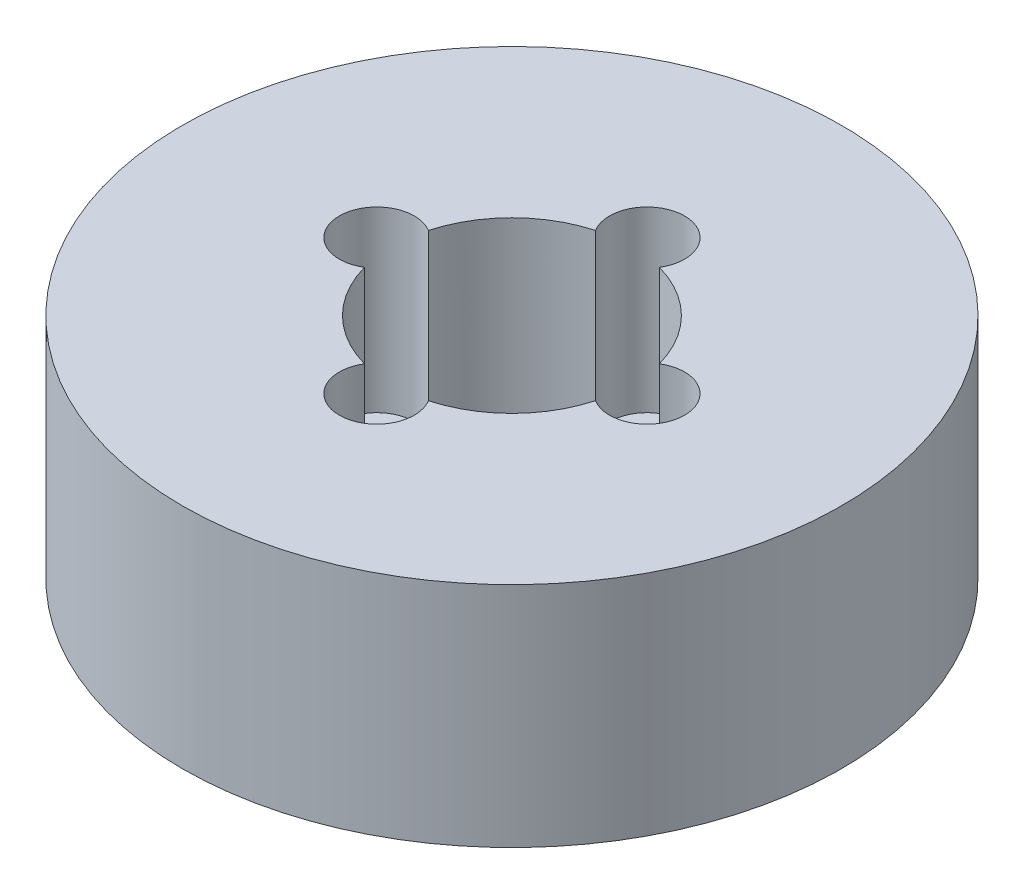
ISO-10303-21;
HEADER;
FILE_DESCRIPTION(('STEP AP214'),'2;1');
FILE_NAME('part.step','',(''),(''),'','','');
FILE_SCHEMA(('AUTOMOTIVE_DESIGN { 1 0 10303 214 1 1 1 1 }'));
ENDSEC;
DATA;
#1=APPLICATION_CONTEXT('core data for automotive mechanical design processes');
#2=APPLICATION_PROTOCOL_DEFINITION('international standard','automotive_design',2000,#1);
#3=PRODUCT_CONTEXT('',#1,'mechanical');
#4=PRODUCT('Part','Part','',(#3));
#5=PRODUCT_RELATED_PRODUCT_CATEGORY('part','',(#4));
#6=PRODUCT_DEFINITION_FORMATION('','',#4);
#7=PRODUCT_DEFINITION_CONTEXT('part definition',#1,'design');
#8=PRODUCT_DEFINITION('design','',#6,#7);
#9=PRODUCT_DEFINITION_SHAPE('','',#8);
#10=(LENGTH_UNIT() NAMED_UNIT(*) SI_UNIT(.MILLI.,.METRE.));
#11=(NAMED_UNIT(*) PLANE_ANGLE_UNIT() SI_UNIT($,.RADIAN.));
#12=(NAMED_UNIT(*) SI_UNIT($,.STERADIAN.) SOLID_ANGLE_UNIT());
#13=UNCERTAINTY_MEASURE_WITH_UNIT(LENGTH_MEASURE(1.E-05),#10,'distance_accuracy_value','');
#14=(GEOMETRIC_REPRESENTATION_CONTEXT(3) GLOBAL_UNCERTAINTY_ASSIGNED_CONTEXT((#13)) GLOBAL_UNIT_ASSIGNED_CONTEXT((#10,
#11,#12)) REPRESENTATION_CONTEXT('',''));
#15=CARTESIAN_POINT('',(0.,0.,0.));
#16=DIRECTION('',(0.,0.,1.));
#17=DIRECTION('',(1.,0.,0.));
#18=AXIS2_PLACEMENT_3D('',#15,#16,#17);
#19=CARTESIAN_POINT('',(0.,19.,0.));
#20=DIRECTION('',(0.,-1.,0.));
#21=DIRECTION('',(0.,0.,-1.));
#22=AXIS2_PLACEMENT_3D('',#19,#20,#21);
#23=CYLINDRICAL_SURFACE('',#22,27.5);
#24=CARTESIAN_POINT('',(0.,19.,0.));
#25=DIRECTION('',(0.,1.,0.));
#26=DIRECTION('',(0.,0.,1.));
#27=AXIS2_PLACEMENT_3D('',#24,#25,#26);
#28=CIRCLE('',#27,27.5);
#29=CARTESIAN_POINT('',(0.,19.,27.5));
#30=VERTEX_POINT('',#29);
#31=EDGE_CURVE('E145',#30,#30,#28,.T.);
#32=ORIENTED_EDGE('',*,*,#31,.F.);
#33=EDGE_LOOP('',(#32));
#34=FACE_BOUND('',#33,.T.);
#35=CARTESIAN_POINT('',(0.,0.,0.));
#36=DIRECTION('',(0.,1.,0.));
#37=DIRECTION('',(0.,0.,1.));
#38=AXIS2_PLACEMENT_3D('',#35,#36,#37);
#39=CIRCLE('',#38,27.5);
#40=CARTESIAN_POINT('',(0.,0.,27.5));
#41=VERTEX_POINT('',#40);
#42=EDGE_CURVE('E143',#41,#41,#39,.T.);
#43=ORIENTED_EDGE('',*,*,#42,.T.);
#44=EDGE_LOOP('',(#43));
#45=FACE_BOUND('',#44,.T.);
#46=ADVANCED_FACE('F39',(#34,#45),#23,.T.);
#47=CARTESIAN_POINT('',(0.,19.,0.));
#48=DIRECTION('',(0.,1.,0.));
#49=DIRECTION('',(0.,0.,1.));
#50=AXIS2_PLACEMENT_3D('',#47,#48,#49);
#51=PLANE('',#50);
#52=CARTESIAN_POINT('',(0.,19.,11.2742594258301));
#53=DIRECTION('',(0.,1.,0.));
#54=DIRECTION('',(1.,0.,0.));
#55=AXIS2_PLACEMENT_3D('',#52,#53,#54);
#56=CIRCLE('',#55,3.1296043589413);
#57=CARTESIAN_POINT('',(-2.66756435026273,19.,9.63763977523581));
#58=VERTEX_POINT('',#57);
#59=CARTESIAN_POINT('',(2.6675643502628,19.,9.63763977523579));
#60=VERTEX_POINT('',#59);
#61=EDGE_CURVE('E152',#58,#60,#56,.T.);
#62=ORIENTED_EDGE('',*,*,#61,.F.);
#63=CARTESIAN_POINT('',(0.,19.,0.));
#64=DIRECTION('',(0.,1.,0.));
#65=DIRECTION('',(0.,0.,1.));
#66=AXIS2_PLACEMENT_3D('',#63,#64,#65);
#67=CIRCLE('',#66,10.);
#68=CARTESIAN_POINT('',(-9.6376397752358,19.,2.66756435026276));
#69=VERTEX_POINT('',#68);
#70=EDGE_CURVE('E133',#69,#58,#67,.T.);
#71=ORIENTED_EDGE('',*,*,#70,.F.);
#72=CARTESIAN_POINT('',(-11.2742594258301,19.,0.));
#73=DIRECTION('',(0.,1.,0.));
#74=DIRECTION('',(0.,0.,1.));
#75=AXIS2_PLACEMENT_3D('',#72,#73,#74);
#76=CIRCLE('',#75,3.1296043589413);
#77=CARTESIAN_POINT('',(-9.6376397752358,19.,-2.66756435026276));
#78=VERTEX_POINT('',#77);
#79=EDGE_CURVE('E128',#78,#69,#76,.T.);
#80=ORIENTED_EDGE('',*,*,#79,.F.);
#81=CARTESIAN_POINT('',(-2.66756435026286,19.,-9.63763977523577));
#82=VERTEX_POINT('',#81);
#83=EDGE_CURVE('E121',#82,#78,#67,.T.);
#84=ORIENTED_EDGE('',*,*,#83,.F.);
#85=CARTESIAN_POINT('',(-1.18091599183687E-13,19.,-11.2742594258301));
#86=DIRECTION('',(0.,1.,0.));
#87=DIRECTION('',(-1.,0.,0.));
#88=AXIS2_PLACEMENT_3D('',#85,#86,#87);
#89=CIRCLE('',#88,3.1296043589413);
#90=CARTESIAN_POINT('',(2.66756435026266,19.,-9.63763977523583));
#91=VERTEX_POINT('',#90);
#92=EDGE_CURVE('E105',#91,#82,#89,.T.);
#93=ORIENTED_EDGE('',*,*,#92,.F.);
#94=CARTESIAN_POINT('',(9.6376397752358,19.,-2.66756435026276));
#95=VERTEX_POINT('',#94);
#96=EDGE_CURVE('E131',#95,#91,#67,.T.);
#97=ORIENTED_EDGE('',*,*,#96,.F.);
#98=CARTESIAN_POINT('',(11.2742594258301,19.,0.));
#99=DIRECTION('',(0.,1.,0.));
#100=DIRECTION('',(0.,0.,-1.));
#101=AXIS2_PLACEMENT_3D('',#98,#99,#100);
#102=CIRCLE('',#101,3.1296043589413);
#103=CARTESIAN_POINT('',(9.6376397752358,19.,2.66756435026276));
#104=VERTEX_POINT('',#103);
#105=EDGE_CURVE('E154',#104,#95,#102,.T.);
#106=ORIENTED_EDGE('',*,*,#105,.F.);
#107=EDGE_CURVE('E134',#60,#104,#67,.T.);
#108=ORIENTED_EDGE('',*,*,#107,.F.);
#109=EDGE_LOOP('',(#62,#71,#80,#84,#93,#97,#106,#108));
#110=FACE_BOUND('',#109,.T.);
#111=ORIENTED_EDGE('',*,*,#31,.T.);
#112=EDGE_LOOP('',(#111));
#113=FACE_BOUND('',#112,.T.);
#114=ADVANCED_FACE('F130',(#110,#113),#51,.T.);
#115=CARTESIAN_POINT('',(0.,0.,0.));
#116=DIRECTION('',(0.,1.,0.));
#117=DIRECTION('',(0.,0.,1.));
#118=AXIS2_PLACEMENT_3D('',#115,#116,#117);
#119=PLANE('',#118);
#120=CARTESIAN_POINT('',(0.,0.,0.));
#121=DIRECTION('',(0.,1.,0.));
#122=DIRECTION('',(0.,0.,1.));
#123=AXIS2_PLACEMENT_3D('',#120,#121,#122);
#124=CIRCLE('',#123,10.);
#125=CARTESIAN_POINT('',(0.,0.,10.));
#126=VERTEX_POINT('',#125);
#127=EDGE_CURVE('E135',#126,#126,#124,.T.);
#128=ORIENTED_EDGE('',*,*,#127,.T.);
#129=EDGE_LOOP('',(#128));
#130=FACE_BOUND('',#129,.T.);
#131=ORIENTED_EDGE('',*,*,#42,.F.);
#132=EDGE_LOOP('',(#131));
#133=FACE_BOUND('',#132,.T.);
#134=ADVANCED_FACE('F195',(#130,#133),#119,.F.);
#135=CARTESIAN_POINT('',(0.,19.,0.));
#136=DIRECTION('',(0.,-1.,0.));
#137=DIRECTION('',(0.,0.,-1.));
#138=AXIS2_PLACEMENT_3D('',#135,#136,#137);
#139=CYLINDRICAL_SURFACE('',#138,10.);
#140=DIRECTION('',(0.,1.,0.));
#141=VECTOR('',#140,1.);
#142=CARTESIAN_POINT('',(-2.66756435026273,11.5670114960892,9.63763977523581));
#143=LINE('',#142,#141);
#144=CARTESIAN_POINT('',(-2.66756435026273,4.13402299217838,9.63763977523581));
#145=VERTEX_POINT('',#144);
#146=EDGE_CURVE('E11',#145,#58,#143,.T.);
#147=ORIENTED_EDGE('',*,*,#146,.F.);
#148=CARTESIAN_POINT('',(0.,4.13402299217838,0.));
#149=DIRECTION('',(0.,1.,0.));
#150=DIRECTION('',(0.,0.,1.));
#151=AXIS2_PLACEMENT_3D('',#148,#149,#150);
#152=CIRCLE('',#151,10.);
#153=CARTESIAN_POINT('',(2.6675643502628,4.13402299217838,9.63763977523579));
#154=VERTEX_POINT('',#153);
#155=EDGE_CURVE('E169',#145,#154,#152,.T.);
#156=ORIENTED_EDGE('',*,*,#155,.T.);
#157=DIRECTION('',(0.,1.,0.));
#158=VECTOR('',#157,1.);
#159=CARTESIAN_POINT('',(2.6675643502628,11.5670114960892,9.63763977523579));
#160=LINE('',#159,#158);
#161=EDGE_CURVE('E46',#60,#154,#160,.F.);
#162=ORIENTED_EDGE('',*,*,#161,.F.);
#163=ORIENTED_EDGE('',*,*,#107,.T.);
#164=DIRECTION('',(0.,1.,0.));
#165=VECTOR('',#164,1.);
#166=CARTESIAN_POINT('',(9.6376397752358,11.5670114960892,2.66756435026276));
#167=LINE('',#166,#165);
#168=CARTESIAN_POINT('',(9.6376397752358,4.13402299217838,2.66756435026276));
#169=VERTEX_POINT('',#168);
#170=EDGE_CURVE('E151',#169,#104,#167,.T.);
#171=ORIENTED_EDGE('',*,*,#170,.F.);
#172=CARTESIAN_POINT('',(0.,4.13402299217838,0.));
#173=DIRECTION('',(0.,1.,0.));
#174=DIRECTION('',(0.,0.,1.));
#175=AXIS2_PLACEMENT_3D('',#172,#173,#174);
#176=CIRCLE('',#175,10.);
#177=CARTESIAN_POINT('',(9.6376397752358,4.13402299217838,-2.66756435026276));
#178=VERTEX_POINT('',#177);
#179=EDGE_CURVE('E173',#169,#178,#176,.T.);
#180=ORIENTED_EDGE('',*,*,#179,.T.);
#181=DIRECTION('',(0.,1.,0.));
#182=VECTOR('',#181,1.);
#183=CARTESIAN_POINT('',(9.6376397752358,11.5670114960892,-2.66756435026276));
#184=LINE('',#183,#182);
#185=EDGE_CURVE('E168',#95,#178,#184,.F.);
#186=ORIENTED_EDGE('',*,*,#185,.F.);
#187=ORIENTED_EDGE('',*,*,#96,.T.);
#188=DIRECTION('',(0.,1.,0.));
#189=VECTOR('',#188,1.);
#190=CARTESIAN_POINT('',(2.66756435026266,11.5670114960892,-9.63763977523583));
#191=LINE('',#190,#189);
#192=CARTESIAN_POINT('',(2.66756435026266,4.13402299217838,-9.63763977523583));
#193=VERTEX_POINT('',#192);
#194=EDGE_CURVE('E108',#193,#91,#191,.T.);
#195=ORIENTED_EDGE('',*,*,#194,.F.);
#196=CARTESIAN_POINT('',(0.,4.13402299217838,0.));
#197=DIRECTION('',(0.,1.,0.));
#198=DIRECTION('',(0.,0.,1.));
#199=AXIS2_PLACEMENT_3D('',#196,#197,#198);
#200=CIRCLE('',#199,10.);
#201=CARTESIAN_POINT('',(-2.66756435026286,4.13402299217838,-9.63763977523577));
#202=VERTEX_POINT('',#201);
#203=EDGE_CURVE('E122',#193,#202,#200,.T.);
#204=ORIENTED_EDGE('',*,*,#203,.T.);
#205=DIRECTION('',(0.,1.,0.));
#206=VECTOR('',#205,1.);
#207=CARTESIAN_POINT('',(-2.66756435026286,11.5670114960892,-9.63763977523577));
#208=LINE('',#207,#206);
#209=EDGE_CURVE('E106',#82,#202,#208,.F.);
#210=ORIENTED_EDGE('',*,*,#209,.F.);
#211=ORIENTED_EDGE('',*,*,#83,.T.);
#212=DIRECTION('',(0.,1.,0.));
#213=VECTOR('',#212,1.);
#214=CARTESIAN_POINT('',(-9.6376397752358,11.5670114960892,-2.66756435026276));
#215=LINE('',#214,#213);
#216=CARTESIAN_POINT('',(-9.6376397752358,4.13402299217838,-2.66756435026276));
#217=VERTEX_POINT('',#216);
#218=EDGE_CURVE('E177',#217,#78,#215,.T.);
#219=ORIENTED_EDGE('',*,*,#218,.F.);
#220=CARTESIAN_POINT('',(0.,4.13402299217838,0.));
#221=DIRECTION('',(0.,1.,0.));
#222=DIRECTION('',(0.,0.,1.));
#223=AXIS2_PLACEMENT_3D('',#220,#221,#222);
#224=CIRCLE('',#223,10.);
#225=CARTESIAN_POINT('',(-9.6376397752358,4.13402299217838,2.66756435026276));
#226=VERTEX_POINT('',#225);
#227=EDGE_CURVE('E185',#217,#226,#224,.T.);
#228=ORIENTED_EDGE('',*,*,#227,.T.);
#229=DIRECTION('',(0.,1.,0.));
#230=VECTOR('',#229,1.);
#231=CARTESIAN_POINT('',(-9.6376397752358,11.5670114960892,2.66756435026276));
#232=LINE('',#231,#230);
#233=EDGE_CURVE('E179',#69,#226,#232,.F.);
#234=ORIENTED_EDGE('',*,*,#233,.F.);
#235=ORIENTED_EDGE('',*,*,#70,.T.);
#236=EDGE_LOOP('',(#147,#156,#162,#163,#171,#180,#186,#187,#195,#204,#210,#211,#219,#228,#234,#235));
#237=FACE_BOUND('',#236,.T.);
#238=ORIENTED_EDGE('',*,*,#127,.F.);
#239=EDGE_LOOP('',(#238));
#240=FACE_BOUND('',#239,.T.);
#241=ADVANCED_FACE('F117',(#237,#240),#139,.F.);
#242=CARTESIAN_POINT('',(-11.2742594258301,4.13402299217838,0.));
#243=DIRECTION('',(0.,1.,0.));
#244=DIRECTION('',(0.,0.,1.));
#245=AXIS2_PLACEMENT_3D('',#242,#243,#244);
#246=CYLINDRICAL_SURFACE('',#245,3.1296043589413);
#247=ORIENTED_EDGE('',*,*,#218,.T.);
#248=ORIENTED_EDGE('',*,*,#79,.T.);
#249=ORIENTED_EDGE('',*,*,#233,.T.);
#250=CARTESIAN_POINT('',(-11.2742594258301,4.13402299217838,0.));
#251=DIRECTION('',(0.,1.,0.));
#252=DIRECTION('',(0.,0.,1.));
#253=AXIS2_PLACEMENT_3D('',#250,#251,#252);
#254=CIRCLE('',#253,3.1296043589413);
#255=EDGE_CURVE('E140',#217,#226,#254,.T.);
#256=ORIENTED_EDGE('',*,*,#255,.F.);
#257=EDGE_LOOP('',(#247,#248,#249,#256));
#258=FACE_BOUND('',#257,.T.);
#259=ADVANCED_FACE('F200',(#258),#246,.F.);
#260=CARTESIAN_POINT('',(-11.2742594258301,4.13402299217838,0.));
#261=DIRECTION('',(0.,1.,0.));
#262=DIRECTION('',(0.,0.,1.));
#263=AXIS2_PLACEMENT_3D('',#260,#261,#262);
#264=PLANE('',#263);
#265=ORIENTED_EDGE('',*,*,#255,.T.);
#266=ORIENTED_EDGE('',*,*,#227,.F.);
#267=EDGE_LOOP('',(#265,#266));
#268=FACE_BOUND('',#267,.T.);
#269=ADVANCED_FACE('F202',(#268),#264,.T.);
#270=CARTESIAN_POINT('',(-1.18091599183687E-13,4.13402299217838,-11.2742594258301));
#271=DIRECTION('',(0.,1.,0.));
#272=DIRECTION('',(0.,0.,1.));
#273=AXIS2_PLACEMENT_3D('',#270,#271,#272);
#274=CYLINDRICAL_SURFACE('',#273,3.1296043589413);
#275=ORIENTED_EDGE('',*,*,#194,.T.);
#276=ORIENTED_EDGE('',*,*,#92,.T.);
#277=ORIENTED_EDGE('',*,*,#209,.T.);
#278=CARTESIAN_POINT('',(-1.18091599183687E-13,4.13402299217838,-11.2742594258301));
#279=DIRECTION('',(0.,1.,0.));
#280=DIRECTION('',(-1.,0.,0.));
#281=AXIS2_PLACEMENT_3D('',#278,#279,#280);
#282=CIRCLE('',#281,3.1296043589413);
#283=EDGE_CURVE('E111',#193,#202,#282,.T.);
#284=ORIENTED_EDGE('',*,*,#283,.F.);
#285=EDGE_LOOP('',(#275,#276,#277,#284));
#286=FACE_BOUND('',#285,.T.);
#287=ADVANCED_FACE('F102',(#286),#274,.F.);
#288=CARTESIAN_POINT('',(-1.18091599183687E-13,4.13402299217838,-11.2742594258301));
#289=DIRECTION('',(0.,1.,0.));
#290=DIRECTION('',(-1.,0.,0.));
#291=AXIS2_PLACEMENT_3D('',#288,#289,#290);
#292=PLANE('',#291);
#293=ORIENTED_EDGE('',*,*,#283,.T.);
#294=ORIENTED_EDGE('',*,*,#203,.F.);
#295=EDGE_LOOP('',(#293,#294));
#296=FACE_BOUND('',#295,.T.);
#297=ADVANCED_FACE('F211',(#296),#292,.T.);
#298=CARTESIAN_POINT('',(11.2742594258301,4.13402299217838,0.));
#299=DIRECTION('',(0.,1.,0.));
#300=DIRECTION('',(0.,0.,1.));
#301=AXIS2_PLACEMENT_3D('',#298,#299,#300);
#302=CYLINDRICAL_SURFACE('',#301,3.1296043589413);
#303=ORIENTED_EDGE('',*,*,#170,.T.);
#304=ORIENTED_EDGE('',*,*,#105,.T.);
#305=ORIENTED_EDGE('',*,*,#185,.T.);
#306=CARTESIAN_POINT('',(11.2742594258301,4.13402299217838,0.));
#307=DIRECTION('',(0.,1.,0.));
#308=DIRECTION('',(0.,0.,-1.));
#309=AXIS2_PLACEMENT_3D('',#306,#307,#308);
#310=CIRCLE('',#309,3.1296043589413);
#311=EDGE_CURVE('E56',#169,#178,#310,.T.);
#312=ORIENTED_EDGE('',*,*,#311,.F.);
#313=EDGE_LOOP('',(#303,#304,#305,#312));
#314=FACE_BOUND('',#313,.T.);
#315=ADVANCED_FACE('F212',(#314),#302,.F.);
#316=CARTESIAN_POINT('',(11.2742594258301,4.13402299217838,0.));
#317=DIRECTION('',(0.,1.,0.));
#318=DIRECTION('',(0.,0.,-1.));
#319=AXIS2_PLACEMENT_3D('',#316,#317,#318);
#320=PLANE('',#319);
#321=ORIENTED_EDGE('',*,*,#311,.T.);
#322=ORIENTED_EDGE('',*,*,#179,.F.);
#323=EDGE_LOOP('',(#321,#322));
#324=FACE_BOUND('',#323,.T.);
#325=ADVANCED_FACE('F217',(#324),#320,.T.);
#326=CARTESIAN_POINT('',(0.,4.13402299217838,11.2742594258301));
#327=DIRECTION('',(0.,1.,0.));
#328=DIRECTION('',(0.,0.,1.));
#329=AXIS2_PLACEMENT_3D('',#326,#327,#328);
#330=CYLINDRICAL_SURFACE('',#329,3.1296043589413);
#331=ORIENTED_EDGE('',*,*,#146,.T.);
#332=ORIENTED_EDGE('',*,*,#61,.T.);
#333=ORIENTED_EDGE('',*,*,#161,.T.);
#334=CARTESIAN_POINT('',(0.,4.13402299217838,11.2742594258301));
#335=DIRECTION('',(0.,1.,0.));
#336=DIRECTION('',(1.,0.,0.));
#337=AXIS2_PLACEMENT_3D('',#334,#335,#336);
#338=CIRCLE('',#337,3.1296043589413);
#339=EDGE_CURVE('E55',#145,#154,#338,.T.);
#340=ORIENTED_EDGE('',*,*,#339,.F.);
#341=EDGE_LOOP('',(#331,#332,#333,#340));
#342=FACE_BOUND('',#341,.T.);
#343=ADVANCED_FACE('F170',(#342),#330,.F.);
#344=CARTESIAN_POINT('',(0.,4.13402299217838,11.2742594258301));
#345=DIRECTION('',(0.,1.,0.));
#346=DIRECTION('',(1.,0.,0.));
#347=AXIS2_PLACEMENT_3D('',#344,#345,#346);
#348=PLANE('',#347);
#349=ORIENTED_EDGE('',*,*,#339,.T.);
#350=ORIENTED_EDGE('',*,*,#155,.F.);
#351=EDGE_LOOP('',(#349,#350));
#352=FACE_BOUND('',#351,.T.);
#353=ADVANCED_FACE('F224',(#352),#348,.T.);
#354=CLOSED_SHELL('',(#46,#114,#134,#241,#259,#269,#287,#297,#315,#325,#343,#353));
#355=MANIFOLD_SOLID_BREP('B2',#354);
#356=ADVANCED_BREP_SHAPE_REPRESENTATION('',(#18,#355),#14);
#357=SHAPE_DEFINITION_REPRESENTATION(#9,#356);
ENDSEC;
END-ISO-10303-21;
